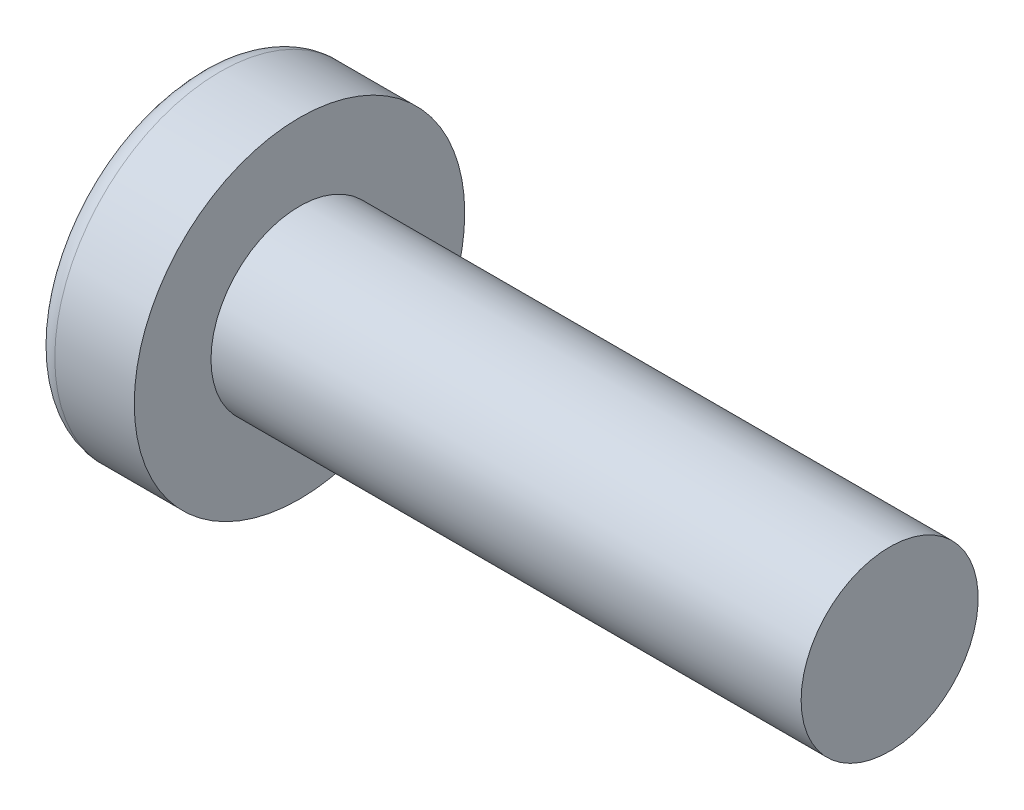
ISO-10303-21;
HEADER;
FILE_DESCRIPTION(('STEP AP214'),'2;1');
FILE_NAME('part.step','',(''),(''),'','','');
FILE_SCHEMA(('AUTOMOTIVE_DESIGN { 1 0 10303 214 1 1 1 1 }'));
ENDSEC;
DATA;
#1=APPLICATION_CONTEXT('core data for automotive mechanical design processes');
#2=APPLICATION_PROTOCOL_DEFINITION('international standard','automotive_design',2000,#1);
#3=PRODUCT_CONTEXT('',#1,'mechanical');
#4=PRODUCT('Part','Part','',(#3));
#5=PRODUCT_RELATED_PRODUCT_CATEGORY('part','',(#4));
#6=PRODUCT_DEFINITION_FORMATION('','',#4);
#7=PRODUCT_DEFINITION_CONTEXT('part definition',#1,'design');
#8=PRODUCT_DEFINITION('design','',#6,#7);
#9=PRODUCT_DEFINITION_SHAPE('','',#8);
#10=(LENGTH_UNIT() NAMED_UNIT(*) SI_UNIT(.MILLI.,.METRE.));
#11=(NAMED_UNIT(*) PLANE_ANGLE_UNIT() SI_UNIT($,.RADIAN.));
#12=(NAMED_UNIT(*) SI_UNIT($,.STERADIAN.) SOLID_ANGLE_UNIT());
#13=UNCERTAINTY_MEASURE_WITH_UNIT(LENGTH_MEASURE(1.E-05),#10,'distance_accuracy_value','');
#14=(GEOMETRIC_REPRESENTATION_CONTEXT(3) GLOBAL_UNCERTAINTY_ASSIGNED_CONTEXT((#13)) GLOBAL_UNIT_ASSIGNED_CONTEXT((#10,
#11,#12)) REPRESENTATION_CONTEXT('',''));
#15=CARTESIAN_POINT('',(0.,0.,0.));
#16=DIRECTION('',(0.,0.,1.));
#17=DIRECTION('',(1.,0.,0.));
#18=AXIS2_PLACEMENT_3D('',#15,#16,#17);
#19=CARTESIAN_POINT('',(5.,0.,0.));
#20=DIRECTION('',(-1.,0.,0.));
#21=DIRECTION('',(0.,1.,0.));
#22=AXIS2_PLACEMENT_3D('',#19,#20,#21);
#23=SPHERICAL_SURFACE('',#22,5.);
#24=CARTESIAN_POINT('',(0.74715070681048,0.,0.));
#25=DIRECTION('',(-1.,0.,0.));
#26=DIRECTION('',(0.,0.,1.));
#27=AXIS2_PLACEMENT_3D('',#24,#25,#26);
#28=CIRCLE('',#27,2.62931034482758);
#29=CARTESIAN_POINT('',(0.74715070681048,0.,2.62931034482758));
#30=VERTEX_POINT('',#29);
#31=EDGE_CURVE('E136',#30,#30,#28,.T.);
#32=ORIENTED_EDGE('',*,*,#31,.T.);
#33=EDGE_LOOP('',(#32));
#34=FACE_BOUND('',#33,.T.);
#35=CARTESIAN_POINT('',(4.98382636322272,-0.153868112043298,0.));
#36=DIRECTION('',(-0.104537710696287,-0.994520923380891,0.));
#37=DIRECTION('',(0.994520923380891,-0.104537710696287,0.));
#38=AXIS2_PLACEMENT_3D('',#35,#36,#37);
#39=CIRCLE('',#38,4.99760572850336);
#40=CARTESIAN_POINT('',(0.188596138461545,0.350175974082162,1.31444652548076));
#41=VERTEX_POINT('',#40);
#42=CARTESIAN_POINT('',(0.0270341343313624,0.367158343834486,0.367158343834487));
#43=VERTEX_POINT('',#42);
#44=EDGE_CURVE('E167',#41,#43,#39,.T.);
#45=ORIENTED_EDGE('',*,*,#44,.F.);
#46=CARTESIAN_POINT('',(3.98403090792016,0.,-1.41352221506761));
#47=DIRECTION('',(0.583636048152575,0.,0.812015371342713));
#48=DIRECTION('',(0.812015371342714,0.,-0.583636048152575));
#49=AXIS2_PLACEMENT_3D('',#46,#47,#48);
#50=CIRCLE('',#49,4.68719124331927);
#51=CARTESIAN_POINT('',(0.188596138461545,-0.350175974082171,1.31444652548076));
#52=VERTEX_POINT('',#51);
#53=EDGE_CURVE('E132',#41,#52,#50,.T.);
#54=ORIENTED_EDGE('',*,*,#53,.T.);
#55=CARTESIAN_POINT('',(4.98382636322272,0.153868112043297,0.));
#56=DIRECTION('',(-0.104537710696287,0.994520923380891,0.));
#57=DIRECTION('',(-0.994520923380891,-0.104537710696287,0.));
#58=AXIS2_PLACEMENT_3D('',#55,#56,#57);
#59=CIRCLE('',#58,4.99760572850336);
#60=CARTESIAN_POINT('',(0.0270341343313616,-0.367158343834489,0.367158343834487));
#61=VERTEX_POINT('',#60);
#62=EDGE_CURVE('E88',#61,#52,#59,.T.);
#63=ORIENTED_EDGE('',*,*,#62,.F.);
#64=CARTESIAN_POINT('',(4.98382636322272,0.,-0.153868112043297));
#65=DIRECTION('',(-0.104537710696287,0.,-0.994520923380891));
#66=DIRECTION('',(-0.994520923380891,0.,0.104537710696287));
#67=AXIS2_PLACEMENT_3D('',#64,#65,#66);
#68=CIRCLE('',#67,4.99760572850336);
#69=CARTESIAN_POINT('',(0.188596138461543,-1.31444652548077,0.350175974082167));
#70=VERTEX_POINT('',#69);
#71=EDGE_CURVE('E113',#70,#61,#68,.T.);
#72=ORIENTED_EDGE('',*,*,#71,.F.);
#73=CARTESIAN_POINT('',(3.98403090792016,1.41352221506761,0.));
#74=DIRECTION('',(0.583636048152575,-0.812015371342713,0.));
#75=DIRECTION('',(0.812015371342714,0.583636048152575,0.));
#76=AXIS2_PLACEMENT_3D('',#73,#74,#75);
#77=CIRCLE('',#76,4.68719124331927);
#78=CARTESIAN_POINT('',(0.188596138461543,-1.31444652548077,-0.350175974082167));
#79=VERTEX_POINT('',#78);
#80=EDGE_CURVE('E121',#70,#79,#77,.T.);
#81=ORIENTED_EDGE('',*,*,#80,.T.);
#82=CARTESIAN_POINT('',(4.98382636322272,0.,0.153868112043298));
#83=DIRECTION('',(-0.104537710696287,0.,0.994520923380891));
#84=DIRECTION('',(0.994520923380891,0.,0.104537710696287));
#85=AXIS2_PLACEMENT_3D('',#82,#83,#84);
#86=CIRCLE('',#85,4.99760572850336);
#87=CARTESIAN_POINT('',(0.0270341343313616,-0.367158343834486,-0.367158343834487));
#88=VERTEX_POINT('',#87);
#89=EDGE_CURVE('E31',#88,#79,#86,.T.);
#90=ORIENTED_EDGE('',*,*,#89,.F.);
#91=CARTESIAN_POINT('',(0.188596138461545,-0.350175974082162,-1.31444652548077));
#92=VERTEX_POINT('',#91);
#93=EDGE_CURVE('E174',#92,#88,#59,.T.);
#94=ORIENTED_EDGE('',*,*,#93,.F.);
#95=CARTESIAN_POINT('',(3.98403090792016,0.,1.41352221506761));
#96=DIRECTION('',(0.583636048152575,0.,-0.812015371342713));
#97=DIRECTION('',(-0.812015371342714,0.,-0.583636048152575));
#98=AXIS2_PLACEMENT_3D('',#95,#96,#97);
#99=CIRCLE('',#98,4.68719124331927);
#100=CARTESIAN_POINT('',(0.188596138461545,0.350175974082172,-1.31444652548076));
#101=VERTEX_POINT('',#100);
#102=EDGE_CURVE('E114',#92,#101,#99,.T.);
#103=ORIENTED_EDGE('',*,*,#102,.T.);
#104=CARTESIAN_POINT('',(0.0270341343313624,0.367158343834489,-0.367158343834487));
#105=VERTEX_POINT('',#104);
#106=EDGE_CURVE('E162',#105,#101,#39,.T.);
#107=ORIENTED_EDGE('',*,*,#106,.F.);
#108=CARTESIAN_POINT('',(0.188596138461545,1.31444652548076,-0.350175974082167));
#109=VERTEX_POINT('',#108);
#110=EDGE_CURVE('E24',#109,#105,#86,.T.);
#111=ORIENTED_EDGE('',*,*,#110,.F.);
#112=CARTESIAN_POINT('',(3.98403090792016,-1.41352221506761,0.));
#113=DIRECTION('',(0.583636048152575,0.812015371342713,0.));
#114=DIRECTION('',(-0.812015371342714,0.583636048152575,0.));
#115=AXIS2_PLACEMENT_3D('',#112,#113,#114);
#116=CIRCLE('',#115,4.68719124331927);
#117=CARTESIAN_POINT('',(0.188596138461545,1.31444652548076,0.350175974082167));
#118=VERTEX_POINT('',#117);
#119=EDGE_CURVE('E11',#109,#118,#116,.T.);
#120=ORIENTED_EDGE('',*,*,#119,.T.);
#121=EDGE_CURVE('E150',#43,#118,#68,.T.);
#122=ORIENTED_EDGE('',*,*,#121,.F.);
#123=EDGE_LOOP('',(#45,#54,#63,#72,#81,#90,#94,#103,#107,#111,#120,#122));
#124=FACE_BOUND('',#123,.T.);
#125=ADVANCED_FACE('F16',(#34,#124),#23,.T.);
#126=CARTESIAN_POINT('',(2.01739130434783,0.,-0.157944664031621));
#127=DIRECTION('',(-0.104537710696287,0.,0.994520923380891));
#128=DIRECTION('',(0.994520923380891,0.,0.104537710696287));
#129=AXIS2_PLACEMENT_3D('',#126,#127,#128);
#130=PLANE('',#129);
#131=ORIENTED_EDGE('',*,*,#110,.T.);
#132=DIRECTION('',(0.989130931836555,-0.103971149085093,0.103971149085092));
#133=VECTOR('',#132,1.);
#134=CARTESIAN_POINT('',(2.03363450411053,0.156237282238383,-0.156237282238382));
#135=LINE('',#134,#133);
#136=CARTESIAN_POINT('',(1.76,0.185,-0.185));
#137=VERTEX_POINT('',#136);
#138=EDGE_CURVE('E156',#105,#137,#135,.T.);
#139=ORIENTED_EDGE('',*,*,#138,.T.);
#140=DIRECTION('',(0.809073553388531,-0.581521616498006,0.0850446632823171));
#141=VECTOR('',#140,1.);
#142=CARTESIAN_POINT('',(0.,1.45,-0.37));
#143=LINE('',#142,#141);
#144=EDGE_CURVE('E137',#109,#137,#143,.T.);
#145=ORIENTED_EDGE('',*,*,#144,.F.);
#146=EDGE_LOOP('',(#131,#139,#145));
#147=FACE_BOUND('',#146,.T.);
#148=ADVANCED_FACE('F155',(#147),#130,.T.);
#149=DIRECTION('',(0.809073553388531,0.581521616498006,0.0850446632823171));
#150=VECTOR('',#149,1.);
#151=CARTESIAN_POINT('',(0.,-1.45,-0.37));
#152=LINE('',#151,#150);
#153=CARTESIAN_POINT('',(1.76,-0.185,-0.185));
#154=VERTEX_POINT('',#153);
#155=EDGE_CURVE('E122',#79,#154,#152,.T.);
#156=ORIENTED_EDGE('',*,*,#155,.T.);
#157=DIRECTION('',(-0.989130931836555,-0.103971149085092,-0.103971149085092));
#158=VECTOR('',#157,1.);
#159=CARTESIAN_POINT('',(2.03363450411053,-0.156237282238382,-0.156237282238382));
#160=LINE('',#159,#158);
#161=EDGE_CURVE('E177',#154,#88,#160,.T.);
#162=ORIENTED_EDGE('',*,*,#161,.T.);
#163=ORIENTED_EDGE('',*,*,#89,.T.);
#164=EDGE_LOOP('',(#156,#162,#163));
#165=FACE_BOUND('',#164,.T.);
#166=ADVANCED_FACE('F192',(#165),#130,.T.);
#167=CARTESIAN_POINT('',(2.01739130434783,0.,0.157944664031621));
#168=DIRECTION('',(-0.104537710696287,0.,-0.994520923380891));
#169=DIRECTION('',(-0.994520923380891,0.,0.104537710696287));
#170=AXIS2_PLACEMENT_3D('',#167,#168,#169);
#171=PLANE('',#170);
#172=DIRECTION('',(0.809073553388531,-0.581521616498006,-0.085044663282317));
#173=VECTOR('',#172,1.);
#174=CARTESIAN_POINT('',(0.,1.45,0.37));
#175=LINE('',#174,#173);
#176=CARTESIAN_POINT('',(1.76,0.185,0.185));
#177=VERTEX_POINT('',#176);
#178=EDGE_CURVE('E193',#118,#177,#175,.T.);
#179=ORIENTED_EDGE('',*,*,#178,.T.);
#180=DIRECTION('',(-0.989130931836555,0.103971149085092,0.103971149085092));
#181=VECTOR('',#180,1.);
#182=CARTESIAN_POINT('',(2.03363450411053,0.156237282238381,0.156237282238383));
#183=LINE('',#182,#181);
#184=EDGE_CURVE('E171',#177,#43,#183,.T.);
#185=ORIENTED_EDGE('',*,*,#184,.T.);
#186=ORIENTED_EDGE('',*,*,#121,.T.);
#187=EDGE_LOOP('',(#179,#185,#186));
#188=FACE_BOUND('',#187,.T.);
#189=ADVANCED_FACE('F197',(#188),#171,.T.);
#190=ORIENTED_EDGE('',*,*,#71,.T.);
#191=DIRECTION('',(0.989130931836555,0.103971149085092,-0.103971149085092));
#192=VECTOR('',#191,1.);
#193=CARTESIAN_POINT('',(2.03363450411053,-0.156237282238383,0.156237282238383));
#194=LINE('',#193,#192);
#195=CARTESIAN_POINT('',(1.76,-0.185,0.185));
#196=VERTEX_POINT('',#195);
#197=EDGE_CURVE('E86',#61,#196,#194,.T.);
#198=ORIENTED_EDGE('',*,*,#197,.T.);
#199=DIRECTION('',(0.809073553388531,0.581521616498006,-0.0850446632823169));
#200=VECTOR('',#199,1.);
#201=CARTESIAN_POINT('',(0.,-1.45,0.37));
#202=LINE('',#201,#200);
#203=EDGE_CURVE('E111',#70,#196,#202,.T.);
#204=ORIENTED_EDGE('',*,*,#203,.F.);
#205=EDGE_LOOP('',(#190,#198,#204));
#206=FACE_BOUND('',#205,.T.);
#207=ADVANCED_FACE('F110',(#206),#171,.T.);
#208=CARTESIAN_POINT('',(-25.4,0.,0.));
#209=DIRECTION('',(-1.,0.,0.));
#210=DIRECTION('',(0.,0.,1.));
#211=AXIS2_PLACEMENT_3D('',#208,#209,#210);
#212=CYLINDRICAL_SURFACE('',#211,1.5);
#213=CARTESIAN_POINT('',(12.4,0.,0.));
#214=DIRECTION('',(-1.,0.,0.));
#215=DIRECTION('',(0.,0.,1.));
#216=AXIS2_PLACEMENT_3D('',#213,#214,#215);
#217=CIRCLE('',#216,1.5);
#218=CARTESIAN_POINT('',(12.4,0.,1.5));
#219=VERTEX_POINT('',#218);
#220=EDGE_CURVE('E133',#219,#219,#217,.T.);
#221=ORIENTED_EDGE('',*,*,#220,.T.);
#222=EDGE_LOOP('',(#221));
#223=FACE_BOUND('',#222,.T.);
#224=CARTESIAN_POINT('',(2.4,0.,0.));
#225=DIRECTION('',(-1.,0.,0.));
#226=DIRECTION('',(0.,0.,1.));
#227=AXIS2_PLACEMENT_3D('',#224,#225,#226);
#228=CIRCLE('',#227,1.5);
#229=CARTESIAN_POINT('',(2.4,0.,1.5));
#230=VERTEX_POINT('',#229);
#231=EDGE_CURVE('E146',#230,#230,#228,.T.);
#232=ORIENTED_EDGE('',*,*,#231,.F.);
#233=EDGE_LOOP('',(#232));
#234=FACE_BOUND('',#233,.T.);
#235=ADVANCED_FACE('F18',(#223,#234),#212,.T.);
#236=CARTESIAN_POINT('',(2.4,1.5,0.));
#237=DIRECTION('',(-1.,0.,0.));
#238=DIRECTION('',(0.,0.,1.));
#239=AXIS2_PLACEMENT_3D('',#236,#237,#238);
#240=PLANE('',#239);
#241=CARTESIAN_POINT('',(2.4,0.,0.));
#242=DIRECTION('',(-1.,0.,0.));
#243=DIRECTION('',(0.,0.,1.));
#244=AXIS2_PLACEMENT_3D('',#241,#242,#243);
#245=CIRCLE('',#244,2.8);
#246=CARTESIAN_POINT('',(2.4,0.,2.8));
#247=VERTEX_POINT('',#246);
#248=EDGE_CURVE('E143',#247,#247,#245,.T.);
#249=ORIENTED_EDGE('',*,*,#248,.F.);
#250=EDGE_LOOP('',(#249));
#251=FACE_BOUND('',#250,.T.);
#252=ORIENTED_EDGE('',*,*,#231,.T.);
#253=EDGE_LOOP('',(#252));
#254=FACE_BOUND('',#253,.T.);
#255=ADVANCED_FACE('F226',(#251,#254),#240,.F.);
#256=CARTESIAN_POINT('',(-25.4,0.,0.));
#257=DIRECTION('',(-1.,0.,0.));
#258=DIRECTION('',(0.,0.,1.));
#259=AXIS2_PLACEMENT_3D('',#256,#257,#258);
#260=CYLINDRICAL_SURFACE('',#259,2.8);
#261=ORIENTED_EDGE('',*,*,#248,.T.);
#262=EDGE_LOOP('',(#261));
#263=FACE_BOUND('',#262,.T.);
#264=CARTESIAN_POINT('',(1.05335585592012,0.,0.));
#265=DIRECTION('',(-1.,0.,0.));
#266=DIRECTION('',(0.,0.,1.));
#267=AXIS2_PLACEMENT_3D('',#264,#265,#266);
#268=CIRCLE('',#267,2.8);
#269=CARTESIAN_POINT('',(1.05335585592012,0.,2.8));
#270=VERTEX_POINT('',#269);
#271=EDGE_CURVE('E140',#270,#270,#268,.T.);
#272=ORIENTED_EDGE('',*,*,#271,.F.);
#273=EDGE_LOOP('',(#272));
#274=FACE_BOUND('',#273,.T.);
#275=ADVANCED_FACE('F223',(#263,#274),#260,.T.);
#276=CARTESIAN_POINT('',(1.05335585592012,0.,0.));
#277=DIRECTION('',(-1.,0.,0.));
#278=DIRECTION('',(0.,0.,1.));
#279=AXIS2_PLACEMENT_3D('',#276,#277,#278);
#280=TOROIDAL_SURFACE('',#279,2.44,0.36);
#281=ORIENTED_EDGE('',*,*,#271,.T.);
#282=EDGE_LOOP('',(#281));
#283=FACE_BOUND('',#282,.T.);
#284=ORIENTED_EDGE('',*,*,#31,.F.);
#285=EDGE_LOOP('',(#284));
#286=FACE_BOUND('',#285,.T.);
#287=ADVANCED_FACE('F220',(#283,#286),#280,.T.);
#288=CARTESIAN_POINT('',(12.4,1.5,0.));
#289=DIRECTION('',(1.,0.,0.));
#290=DIRECTION('',(0.,0.,-1.));
#291=AXIS2_PLACEMENT_3D('',#288,#289,#290);
#292=PLANE('',#291);
#293=ORIENTED_EDGE('',*,*,#220,.F.);
#294=EDGE_LOOP('',(#293));
#295=FACE_BOUND('',#294,.T.);
#296=ADVANCED_FACE('F218',(#295),#292,.T.);
#297=CARTESIAN_POINT('',(1.76,0.185,0.185));
#298=DIRECTION('',(0.583636048152575,0.812015371342713,0.));
#299=DIRECTION('',(-0.812015371342714,0.583636048152575,0.));
#300=AXIS2_PLACEMENT_3D('',#297,#298,#299);
#301=PLANE('',#300);
#302=ORIENTED_EDGE('',*,*,#144,.T.);
#303=DIRECTION('',(0.,0.,-1.));
#304=VECTOR('',#303,1.);
#305=CARTESIAN_POINT('',(1.76,0.185,0.185));
#306=LINE('',#305,#304);
#307=EDGE_CURVE('E104',#177,#137,#306,.T.);
#308=ORIENTED_EDGE('',*,*,#307,.F.);
#309=ORIENTED_EDGE('',*,*,#178,.F.);
#310=ORIENTED_EDGE('',*,*,#119,.F.);
#311=EDGE_LOOP('',(#302,#308,#309,#310));
#312=FACE_BOUND('',#311,.T.);
#313=ADVANCED_FACE('F196',(#312),#301,.F.);
#314=CARTESIAN_POINT('',(1.76,-0.185,-0.185));
#315=DIRECTION('',(0.583636048152575,-0.812015371342713,0.));
#316=DIRECTION('',(0.812015371342714,0.583636048152575,0.));
#317=AXIS2_PLACEMENT_3D('',#314,#315,#316);
#318=PLANE('',#317);
#319=ORIENTED_EDGE('',*,*,#203,.T.);
#320=DIRECTION('',(0.,0.,1.));
#321=VECTOR('',#320,1.);
#322=CARTESIAN_POINT('',(1.76,-0.185,-0.185));
#323=LINE('',#322,#321);
#324=EDGE_CURVE('E103',#154,#196,#323,.T.);
#325=ORIENTED_EDGE('',*,*,#324,.F.);
#326=ORIENTED_EDGE('',*,*,#155,.F.);
#327=ORIENTED_EDGE('',*,*,#80,.F.);
#328=EDGE_LOOP('',(#319,#325,#326,#327));
#329=FACE_BOUND('',#328,.T.);
#330=ADVANCED_FACE('F118',(#329),#318,.F.);
#331=CARTESIAN_POINT('',(1.76,-0.185,-0.185));
#332=DIRECTION('',(1.,0.,0.));
#333=DIRECTION('',(0.,0.,-1.));
#334=AXIS2_PLACEMENT_3D('',#331,#332,#333);
#335=PLANE('',#334);
#336=DIRECTION('',(0.,1.,0.));
#337=VECTOR('',#336,1.);
#338=CARTESIAN_POINT('',(1.76,-0.185,-0.185));
#339=LINE('',#338,#337);
#340=EDGE_CURVE('E126',#154,#137,#339,.T.);
#341=ORIENTED_EDGE('',*,*,#340,.F.);
#342=ORIENTED_EDGE('',*,*,#324,.T.);
#343=DIRECTION('',(0.,-1.,0.));
#344=VECTOR('',#343,1.);
#345=CARTESIAN_POINT('',(1.76,0.185,0.185));
#346=LINE('',#345,#344);
#347=EDGE_CURVE('E95',#177,#196,#346,.T.);
#348=ORIENTED_EDGE('',*,*,#347,.F.);
#349=ORIENTED_EDGE('',*,*,#307,.T.);
#350=EDGE_LOOP('',(#341,#342,#348,#349));
#351=FACE_BOUND('',#350,.T.);
#352=ADVANCED_FACE('F124',(#351),#335,.F.);
#353=CARTESIAN_POINT('',(1.76,0.185,-0.185));
#354=DIRECTION('',(0.583636048152575,0.,-0.812015371342713));
#355=DIRECTION('',(0.812015371342714,0.,0.583636048152575));
#356=AXIS2_PLACEMENT_3D('',#353,#354,#355);
#357=PLANE('',#356);
#358=DIRECTION('',(0.809073553388531,0.0850446632823149,0.581521616498007));
#359=VECTOR('',#358,1.);
#360=CARTESIAN_POINT('',(0.,-0.369999999999994,-1.45));
#361=LINE('',#360,#359);
#362=EDGE_CURVE('E182',#92,#154,#361,.T.);
#363=ORIENTED_EDGE('',*,*,#362,.T.);
#364=ORIENTED_EDGE('',*,*,#340,.T.);
#365=DIRECTION('',(0.809073553388531,-0.0850446632823192,0.581521616498006));
#366=VECTOR('',#365,1.);
#367=CARTESIAN_POINT('',(0.,0.370000000000005,-1.45));
#368=LINE('',#367,#366);
#369=EDGE_CURVE('E92',#101,#137,#368,.T.);
#370=ORIENTED_EDGE('',*,*,#369,.F.);
#371=ORIENTED_EDGE('',*,*,#102,.F.);
#372=EDGE_LOOP('',(#363,#364,#370,#371));
#373=FACE_BOUND('',#372,.T.);
#374=ADVANCED_FACE('F187',(#373),#357,.F.);
#375=CARTESIAN_POINT('',(2.01739130434783,-0.157944664031621,0.));
#376=DIRECTION('',(-0.104537710696287,0.994520923380891,0.));
#377=DIRECTION('',(-0.994520923380891,-0.104537710696287,0.));
#378=AXIS2_PLACEMENT_3D('',#375,#376,#377);
#379=PLANE('',#378);
#380=ORIENTED_EDGE('',*,*,#93,.T.);
#381=ORIENTED_EDGE('',*,*,#161,.F.);
#382=ORIENTED_EDGE('',*,*,#362,.F.);
#383=EDGE_LOOP('',(#380,#381,#382));
#384=FACE_BOUND('',#383,.T.);
#385=ADVANCED_FACE('F191',(#384),#379,.T.);
#386=CARTESIAN_POINT('',(2.01739130434783,0.157944664031621,0.));
#387=DIRECTION('',(-0.104537710696287,-0.994520923380891,0.));
#388=DIRECTION('',(0.994520923380891,-0.104537710696287,0.));
#389=AXIS2_PLACEMENT_3D('',#386,#387,#388);
#390=PLANE('',#389);
#391=ORIENTED_EDGE('',*,*,#106,.T.);
#392=ORIENTED_EDGE('',*,*,#369,.T.);
#393=ORIENTED_EDGE('',*,*,#138,.F.);
#394=EDGE_LOOP('',(#391,#392,#393));
#395=FACE_BOUND('',#394,.T.);
#396=ADVANCED_FACE('F185',(#395),#390,.T.);
#397=CARTESIAN_POINT('',(1.76,-0.185,0.185));
#398=DIRECTION('',(0.583636048152575,0.,0.812015371342713));
#399=DIRECTION('',(-0.812015371342714,0.,0.583636048152575));
#400=AXIS2_PLACEMENT_3D('',#397,#398,#399);
#401=PLANE('',#400);
#402=DIRECTION('',(0.809073553388531,-0.0850446632823151,-0.581521616498007));
#403=VECTOR('',#402,1.);
#404=CARTESIAN_POINT('',(0.,0.369999999999995,1.45));
#405=LINE('',#404,#403);
#406=EDGE_CURVE('E91',#41,#177,#405,.T.);
#407=ORIENTED_EDGE('',*,*,#406,.T.);
#408=ORIENTED_EDGE('',*,*,#347,.T.);
#409=DIRECTION('',(0.809073553388531,0.085044663282319,-0.581521616498006));
#410=VECTOR('',#409,1.);
#411=CARTESIAN_POINT('',(0.,-0.370000000000005,1.45));
#412=LINE('',#411,#410);
#413=EDGE_CURVE('E82',#52,#196,#412,.T.);
#414=ORIENTED_EDGE('',*,*,#413,.F.);
#415=ORIENTED_EDGE('',*,*,#53,.F.);
#416=EDGE_LOOP('',(#407,#408,#414,#415));
#417=FACE_BOUND('',#416,.T.);
#418=ADVANCED_FACE('F96',(#417),#401,.F.);
#419=ORIENTED_EDGE('',*,*,#44,.T.);
#420=ORIENTED_EDGE('',*,*,#184,.F.);
#421=ORIENTED_EDGE('',*,*,#406,.F.);
#422=EDGE_LOOP('',(#419,#420,#421));
#423=FACE_BOUND('',#422,.T.);
#424=ADVANCED_FACE('F198',(#423),#390,.T.);
#425=ORIENTED_EDGE('',*,*,#62,.T.);
#426=ORIENTED_EDGE('',*,*,#413,.T.);
#427=ORIENTED_EDGE('',*,*,#197,.F.);
#428=EDGE_LOOP('',(#425,#426,#427));
#429=FACE_BOUND('',#428,.T.);
#430=ADVANCED_FACE('F84',(#429),#379,.T.);
#431=CLOSED_SHELL('',(#125,#148,#166,#189,#207,#235,#255,#275,#287,#296,#313,#330,#352,#374,
#385,#396,#418,#424,#430));
#432=MANIFOLD_SOLID_BREP('B1',#431);
#433=ADVANCED_BREP_SHAPE_REPRESENTATION('',(#18,#432),#14);
#434=SHAPE_DEFINITION_REPRESENTATION(#9,#433);
ENDSEC;
END-ISO-10303-21;
